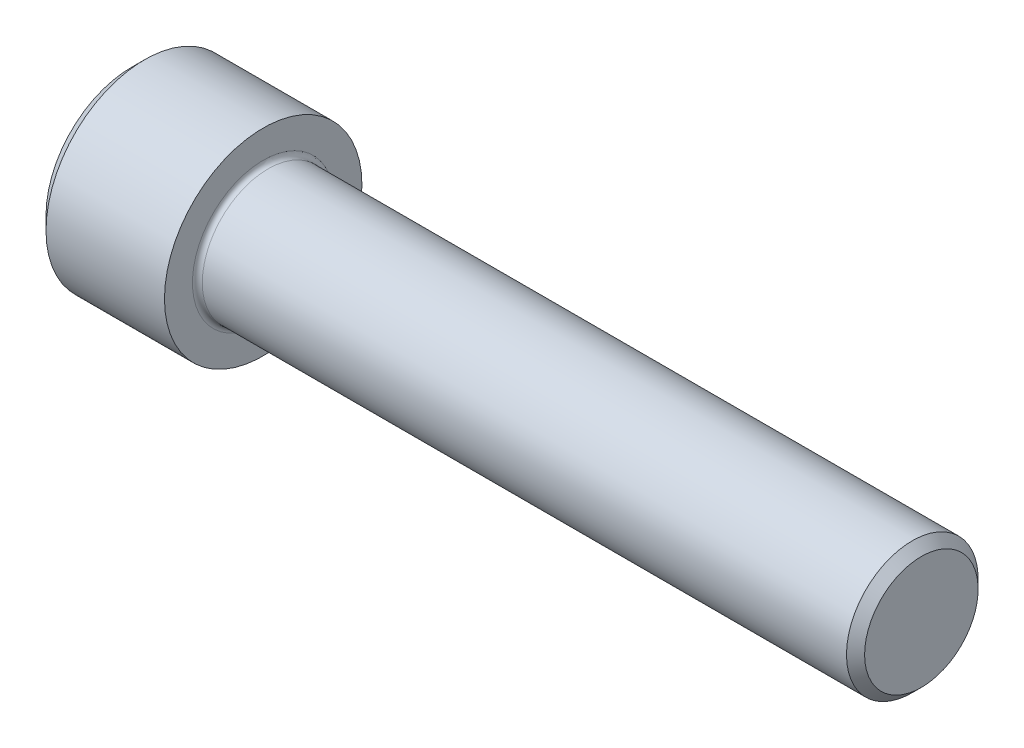
ISO-10303-21;
HEADER;
FILE_DESCRIPTION(('STEP AP214'),'2;1');
FILE_NAME('part.step','',(''),(''),'','','');
FILE_SCHEMA(('AUTOMOTIVE_DESIGN { 1 0 10303 214 1 1 1 1 }'));
ENDSEC;
DATA;
#1=APPLICATION_CONTEXT('core data for automotive mechanical design processes');
#2=APPLICATION_PROTOCOL_DEFINITION('international standard','automotive_design',2000,#1);
#3=PRODUCT_CONTEXT('',#1,'mechanical');
#4=PRODUCT('Part','Part','',(#3));
#5=PRODUCT_RELATED_PRODUCT_CATEGORY('part','',(#4));
#6=PRODUCT_DEFINITION_FORMATION('','',#4);
#7=PRODUCT_DEFINITION_CONTEXT('part definition',#1,'design');
#8=PRODUCT_DEFINITION('design','',#6,#7);
#9=PRODUCT_DEFINITION_SHAPE('','',#8);
#10=(LENGTH_UNIT() NAMED_UNIT(*) SI_UNIT(.MILLI.,.METRE.));
#11=(NAMED_UNIT(*) PLANE_ANGLE_UNIT() SI_UNIT($,.RADIAN.));
#12=(NAMED_UNIT(*) SI_UNIT($,.STERADIAN.) SOLID_ANGLE_UNIT());
#13=UNCERTAINTY_MEASURE_WITH_UNIT(LENGTH_MEASURE(1.E-05),#10,'distance_accuracy_value','');
#14=(GEOMETRIC_REPRESENTATION_CONTEXT(3) GLOBAL_UNCERTAINTY_ASSIGNED_CONTEXT((#13)) GLOBAL_UNIT_ASSIGNED_CONTEXT((#10,
#11,#12)) REPRESENTATION_CONTEXT('',''));
#15=CARTESIAN_POINT('',(0.,0.,0.));
#16=DIRECTION('',(0.,0.,1.));
#17=DIRECTION('',(1.,0.,0.));
#18=AXIS2_PLACEMENT_3D('',#15,#16,#17);
#19=CARTESIAN_POINT('',(0.,0.,0.));
#20=DIRECTION('',(-1.,0.,0.));
#21=DIRECTION('',(0.,0.,1.));
#22=AXIS2_PLACEMENT_3D('',#19,#20,#21);
#23=PLANE('',#22);
#24=DIRECTION('',(0.,-0.5,0.866025403784439));
#25=VECTOR('',#24,1.);
#26=CARTESIAN_POINT('',(0.,8.16488750687969,0.));
#27=LINE('',#26,#25);
#28=CARTESIAN_POINT('',(0.,8.16488750687969,0.));
#29=VERTEX_POINT('',#28);
#30=CARTESIAN_POINT('',(0.,4.08244375343985,7.07099999999999));
#31=VERTEX_POINT('',#30);
#32=EDGE_CURVE('E377',#29,#31,#27,.T.);
#33=ORIENTED_EDGE('',*,*,#32,.T.);
#34=DIRECTION('',(0.,1.,0.));
#35=VECTOR('',#34,1.);
#36=CARTESIAN_POINT('',(0.,-4.08244375343984,7.071));
#37=LINE('',#36,#35);
#38=CARTESIAN_POINT('',(0.,-4.08244375343984,7.071));
#39=VERTEX_POINT('',#38);
#40=EDGE_CURVE('E134',#39,#31,#37,.T.);
#41=ORIENTED_EDGE('',*,*,#40,.F.);
#42=DIRECTION('',(0.,-0.500000000000001,-0.866025403784438));
#43=VECTOR('',#42,1.);
#44=CARTESIAN_POINT('',(0.,-4.08244375343984,7.071));
#45=LINE('',#44,#43);
#46=CARTESIAN_POINT('',(0.,-8.1648875068797,0.));
#47=VERTEX_POINT('',#46);
#48=EDGE_CURVE('E380',#39,#47,#45,.T.);
#49=ORIENTED_EDGE('',*,*,#48,.T.);
#50=DIRECTION('',(0.,0.5,-0.866025403784439));
#51=VECTOR('',#50,1.);
#52=CARTESIAN_POINT('',(0.,-8.1648875068797,0.));
#53=LINE('',#52,#51);
#54=CARTESIAN_POINT('',(0.,-4.08244375343985,-7.071));
#55=VERTEX_POINT('',#54);
#56=EDGE_CURVE('E383',#47,#55,#53,.T.);
#57=ORIENTED_EDGE('',*,*,#56,.T.);
#58=DIRECTION('',(0.,-1.,0.));
#59=VECTOR('',#58,1.);
#60=CARTESIAN_POINT('',(0.,4.08244375343984,-7.07100000000001));
#61=LINE('',#60,#59);
#62=CARTESIAN_POINT('',(0.,4.08244375343984,-7.07100000000001));
#63=VERTEX_POINT('',#62);
#64=EDGE_CURVE('E386',#63,#55,#61,.T.);
#65=ORIENTED_EDGE('',*,*,#64,.F.);
#66=DIRECTION('',(0.,-0.500000000000001,-0.866025403784438));
#67=VECTOR('',#66,1.);
#68=CARTESIAN_POINT('',(0.,8.16488750687969,0.));
#69=LINE('',#68,#67);
#70=EDGE_CURVE('E129',#29,#63,#69,.T.);
#71=ORIENTED_EDGE('',*,*,#70,.F.);
#72=EDGE_LOOP('',(#33,#41,#49,#57,#65,#71));
#73=FACE_BOUND('',#72,.T.);
#74=CARTESIAN_POINT('',(0.,0.,0.));
#75=DIRECTION('',(-1.,0.,0.));
#76=DIRECTION('',(0.,0.,1.));
#77=AXIS2_PLACEMENT_3D('',#74,#75,#76);
#78=CIRCLE('',#77,10.4);
#79=CARTESIAN_POINT('',(0.,0.,10.4));
#80=VERTEX_POINT('',#79);
#81=EDGE_CURVE('E145',#80,#80,#78,.T.);
#82=ORIENTED_EDGE('',*,*,#81,.T.);
#83=EDGE_LOOP('',(#82));
#84=FACE_BOUND('',#83,.T.);
#85=ADVANCED_FACE('F38',(#73,#84),#23,.T.);
#86=CARTESIAN_POINT('',(96.,6.8985,0.));
#87=DIRECTION('',(1.,0.,0.));
#88=DIRECTION('',(0.,0.,-1.));
#89=AXIS2_PLACEMENT_3D('',#86,#87,#88);
#90=PLANE('',#89);
#91=CARTESIAN_POINT('',(96.,0.,0.));
#92=DIRECTION('',(-1.,0.,0.));
#93=DIRECTION('',(0.,0.,1.));
#94=AXIS2_PLACEMENT_3D('',#91,#92,#93);
#95=CIRCLE('',#94,6.8985);
#96=CARTESIAN_POINT('',(96.,0.,6.8985));
#97=VERTEX_POINT('',#96);
#98=EDGE_CURVE('E158',#97,#97,#95,.T.);
#99=ORIENTED_EDGE('',*,*,#98,.F.);
#100=EDGE_LOOP('',(#99));
#101=FACE_BOUND('',#100,.T.);
#102=ADVANCED_FACE('F179',(#101),#90,.T.);
#103=CARTESIAN_POINT('',(96.,0.,0.));
#104=DIRECTION('',(-1.,0.,0.));
#105=DIRECTION('',(0.,0.,1.));
#106=AXIS2_PLACEMENT_3D('',#103,#104,#105);
#107=CONICAL_SURFACE('',#106,6.8985,0.785398163397322);
#108=CARTESIAN_POINT('',(94.8984999999999,0.,0.));
#109=DIRECTION('',(-1.,0.,0.));
#110=DIRECTION('',(0.,0.,1.));
#111=AXIS2_PLACEMENT_3D('',#108,#109,#110);
#112=CIRCLE('',#111,7.99999999999987);
#113=CARTESIAN_POINT('',(94.8984999999999,0.,7.99999999999987));
#114=VERTEX_POINT('',#113);
#115=EDGE_CURVE('E155',#114,#114,#112,.T.);
#116=ORIENTED_EDGE('',*,*,#115,.F.);
#117=EDGE_LOOP('',(#116));
#118=FACE_BOUND('',#117,.T.);
#119=ORIENTED_EDGE('',*,*,#98,.T.);
#120=EDGE_LOOP('',(#119));
#121=FACE_BOUND('',#120,.T.);
#122=ADVANCED_FACE('F185',(#118,#121),#107,.T.);
#123=CARTESIAN_POINT('',(-31.75,0.,0.));
#124=DIRECTION('',(-1.,0.,0.));
#125=DIRECTION('',(0.,0.,1.));
#126=AXIS2_PLACEMENT_3D('',#123,#124,#125);
#127=CYLINDRICAL_SURFACE('',#126,7.99999999999993);
#128=CARTESIAN_POINT('',(16.6,0.,0.));
#129=DIRECTION('',(1.,0.,0.));
#130=DIRECTION('',(0.,0.,-1.));
#131=AXIS2_PLACEMENT_3D('',#128,#129,#130);
#132=CIRCLE('',#131,7.99999999999993);
#133=CARTESIAN_POINT('',(16.6,0.,-7.99999999999993));
#134=VERTEX_POINT('',#133);
#135=EDGE_CURVE('E11',#134,#134,#132,.T.);
#136=ORIENTED_EDGE('',*,*,#135,.T.);
#137=EDGE_LOOP('',(#136));
#138=FACE_BOUND('',#137,.T.);
#139=ORIENTED_EDGE('',*,*,#115,.T.);
#140=EDGE_LOOP('',(#139));
#141=FACE_BOUND('',#140,.T.);
#142=ADVANCED_FACE('F196',(#138,#141),#127,.T.);
#143=CARTESIAN_POINT('',(16.,12.,0.));
#144=DIRECTION('',(1.,0.,0.));
#145=DIRECTION('',(0.,0.,-1.));
#146=AXIS2_PLACEMENT_3D('',#143,#144,#145);
#147=PLANE('',#146);
#148=CARTESIAN_POINT('',(16.,0.,0.));
#149=DIRECTION('',(1.,0.,0.));
#150=DIRECTION('',(0.,0.,-1.));
#151=AXIS2_PLACEMENT_3D('',#148,#149,#150);
#152=CIRCLE('',#151,8.59999999999993);
#153=CARTESIAN_POINT('',(16.,0.,-8.59999999999993));
#154=VERTEX_POINT('',#153);
#155=EDGE_CURVE('E46',#154,#154,#152,.F.);
#156=ORIENTED_EDGE('',*,*,#155,.T.);
#157=EDGE_LOOP('',(#156));
#158=FACE_BOUND('',#157,.T.);
#159=CARTESIAN_POINT('',(16.,0.,0.));
#160=DIRECTION('',(-1.,0.,0.));
#161=DIRECTION('',(0.,0.,1.));
#162=AXIS2_PLACEMENT_3D('',#159,#160,#161);
#163=CIRCLE('',#162,12.);
#164=CARTESIAN_POINT('',(16.,0.,12.));
#165=VERTEX_POINT('',#164);
#166=EDGE_CURVE('E152',#165,#165,#163,.T.);
#167=ORIENTED_EDGE('',*,*,#166,.F.);
#168=EDGE_LOOP('',(#167));
#169=FACE_BOUND('',#168,.T.);
#170=ADVANCED_FACE('F163',(#158,#169),#147,.T.);
#171=CARTESIAN_POINT('',(-31.75,0.,0.));
#172=DIRECTION('',(-1.,0.,0.));
#173=DIRECTION('',(0.,0.,1.));
#174=AXIS2_PLACEMENT_3D('',#171,#172,#173);
#175=CYLINDRICAL_SURFACE('',#174,12.);
#176=ORIENTED_EDGE('',*,*,#166,.T.);
#177=EDGE_LOOP('',(#176));
#178=FACE_BOUND('',#177,.T.);
#179=CARTESIAN_POINT('',(1.6,0.,0.));
#180=DIRECTION('',(-1.,0.,0.));
#181=DIRECTION('',(0.,0.,1.));
#182=AXIS2_PLACEMENT_3D('',#179,#180,#181);
#183=CIRCLE('',#182,12.);
#184=CARTESIAN_POINT('',(1.6,0.,12.));
#185=VERTEX_POINT('',#184);
#186=EDGE_CURVE('E149',#185,#185,#183,.T.);
#187=ORIENTED_EDGE('',*,*,#186,.F.);
#188=EDGE_LOOP('',(#187));
#189=FACE_BOUND('',#188,.T.);
#190=ADVANCED_FACE('F174',(#178,#189),#175,.T.);
#191=CARTESIAN_POINT('',(0.,0.,0.));
#192=DIRECTION('',(1.,0.,0.));
#193=DIRECTION('',(0.,0.,-1.));
#194=AXIS2_PLACEMENT_3D('',#191,#192,#193);
#195=CONICAL_SURFACE('',#194,10.4,0.785398163397447);
#196=ORIENTED_EDGE('',*,*,#186,.T.);
#197=EDGE_LOOP('',(#196));
#198=FACE_BOUND('',#197,.T.);
#199=ORIENTED_EDGE('',*,*,#81,.F.);
#200=EDGE_LOOP('',(#199));
#201=FACE_BOUND('',#200,.T.);
#202=ADVANCED_FACE('F167',(#198,#201),#195,.T.);
#203=CARTESIAN_POINT('',(16.6,0.,0.));
#204=DIRECTION('',(1.,0.,0.));
#205=DIRECTION('',(0.,0.,-1.));
#206=AXIS2_PLACEMENT_3D('',#203,#204,#205);
#207=TOROIDAL_SURFACE('',#206,8.59999999999993,0.6);
#208=ORIENTED_EDGE('',*,*,#135,.F.);
#209=EDGE_LOOP('',(#208));
#210=FACE_BOUND('',#209,.T.);
#211=ORIENTED_EDGE('',*,*,#155,.F.);
#212=EDGE_LOOP('',(#211));
#213=FACE_BOUND('',#212,.T.);
#214=ADVANCED_FACE('F40',(#210,#213),#207,.F.);
#215=CARTESIAN_POINT('',(8.,8.16488750687969,0.));
#216=DIRECTION('',(0.,-0.866025403784439,-0.5));
#217=DIRECTION('',(0.,0.5,-0.866025403784439));
#218=AXIS2_PLACEMENT_3D('',#215,#216,#217);
#219=PLANE('',#218);
#220=ORIENTED_EDGE('',*,*,#32,.F.);
#221=DIRECTION('',(-1.,0.,0.));
#222=VECTOR('',#221,1.);
#223=CARTESIAN_POINT('',(8.,8.16488750687969,0.));
#224=LINE('',#223,#222);
#225=CARTESIAN_POINT('',(8.,8.16488750687969,0.));
#226=VERTEX_POINT('',#225);
#227=EDGE_CURVE('E367',#226,#29,#224,.T.);
#228=ORIENTED_EDGE('',*,*,#227,.F.);
#229=DIRECTION('',(0.,-0.5,0.866025403784439));
#230=VECTOR('',#229,1.);
#231=CARTESIAN_POINT('',(8.,8.16488750687969,0.));
#232=LINE('',#231,#230);
#233=CARTESIAN_POINT('',(8.,6.12366563015976,3.5355));
#234=VERTEX_POINT('',#233);
#235=EDGE_CURVE('E121',#226,#234,#232,.T.);
#236=ORIENTED_EDGE('',*,*,#235,.T.);
#237=CARTESIAN_POINT('',(8.,4.08244375343985,7.07099999999999));
#238=VERTEX_POINT('',#237);
#239=EDGE_CURVE('E112',#234,#238,#232,.T.);
#240=ORIENTED_EDGE('',*,*,#239,.T.);
#241=DIRECTION('',(-1.,0.,0.));
#242=VECTOR('',#241,1.);
#243=CARTESIAN_POINT('',(8.,4.08244375343985,7.07099999999999));
#244=LINE('',#243,#242);
#245=EDGE_CURVE('E126',#238,#31,#244,.T.);
#246=ORIENTED_EDGE('',*,*,#245,.T.);
#247=EDGE_LOOP('',(#220,#228,#236,#240,#246));
#248=FACE_BOUND('',#247,.T.);
#249=ADVANCED_FACE('F125',(#248),#219,.T.);
#250=CARTESIAN_POINT('',(8.,-4.08244375343984,7.071));
#251=DIRECTION('',(0.,0.,1.));
#252=DIRECTION('',(0.,-1.,0.));
#253=AXIS2_PLACEMENT_3D('',#250,#251,#252);
#254=PLANE('',#253);
#255=ORIENTED_EDGE('',*,*,#40,.T.);
#256=ORIENTED_EDGE('',*,*,#245,.F.);
#257=DIRECTION('',(0.,1.,0.));
#258=VECTOR('',#257,1.);
#259=CARTESIAN_POINT('',(8.,-4.08244375343984,7.071));
#260=LINE('',#259,#258);
#261=CARTESIAN_POINT('',(8.,0.,7.071));
#262=VERTEX_POINT('',#261);
#263=EDGE_CURVE('E109',#262,#238,#260,.T.);
#264=ORIENTED_EDGE('',*,*,#263,.F.);
#265=CARTESIAN_POINT('',(8.,-4.08244375343984,7.071));
#266=VERTEX_POINT('',#265);
#267=EDGE_CURVE('E120',#266,#262,#260,.T.);
#268=ORIENTED_EDGE('',*,*,#267,.F.);
#269=DIRECTION('',(-1.,0.,0.));
#270=VECTOR('',#269,1.);
#271=CARTESIAN_POINT('',(8.,-4.08244375343984,7.071));
#272=LINE('',#271,#270);
#273=EDGE_CURVE('E136',#266,#39,#272,.T.);
#274=ORIENTED_EDGE('',*,*,#273,.T.);
#275=EDGE_LOOP('',(#255,#256,#264,#268,#274));
#276=FACE_BOUND('',#275,.T.);
#277=ADVANCED_FACE('F131',(#276),#254,.F.);
#278=CARTESIAN_POINT('',(8.,-4.08244375343984,7.071));
#279=DIRECTION('',(0.,0.866025403784438,-0.500000000000001));
#280=DIRECTION('',(0.,0.500000000000001,0.866025403784438));
#281=AXIS2_PLACEMENT_3D('',#278,#279,#280);
#282=PLANE('',#281);
#283=ORIENTED_EDGE('',*,*,#48,.F.);
#284=ORIENTED_EDGE('',*,*,#273,.F.);
#285=DIRECTION('',(0.,-0.500000000000001,-0.866025403784438));
#286=VECTOR('',#285,1.);
#287=CARTESIAN_POINT('',(8.,-4.08244375343984,7.071));
#288=LINE('',#287,#286);
#289=CARTESIAN_POINT('',(8.,-6.12366563015977,3.53550000000001));
#290=VERTEX_POINT('',#289);
#291=EDGE_CURVE('E406',#266,#290,#288,.T.);
#292=ORIENTED_EDGE('',*,*,#291,.T.);
#293=CARTESIAN_POINT('',(8.,-8.1648875068797,0.));
#294=VERTEX_POINT('',#293);
#295=EDGE_CURVE('E395',#290,#294,#288,.T.);
#296=ORIENTED_EDGE('',*,*,#295,.T.);
#297=DIRECTION('',(-1.,0.,0.));
#298=VECTOR('',#297,1.);
#299=CARTESIAN_POINT('',(8.,-8.1648875068797,0.));
#300=LINE('',#299,#298);
#301=EDGE_CURVE('E141',#294,#47,#300,.T.);
#302=ORIENTED_EDGE('',*,*,#301,.T.);
#303=EDGE_LOOP('',(#283,#284,#292,#296,#302));
#304=FACE_BOUND('',#303,.T.);
#305=ADVANCED_FACE('F258',(#304),#282,.T.);
#306=CARTESIAN_POINT('',(8.,-8.1648875068797,0.));
#307=DIRECTION('',(0.,0.866025403784439,0.5));
#308=DIRECTION('',(0.,-0.5,0.866025403784439));
#309=AXIS2_PLACEMENT_3D('',#306,#307,#308);
#310=PLANE('',#309);
#311=ORIENTED_EDGE('',*,*,#56,.F.);
#312=ORIENTED_EDGE('',*,*,#301,.F.);
#313=DIRECTION('',(0.,0.5,-0.866025403784439));
#314=VECTOR('',#313,1.);
#315=CARTESIAN_POINT('',(8.,-8.1648875068797,0.));
#316=LINE('',#315,#314);
#317=CARTESIAN_POINT('',(8.,-6.12366563015977,-3.5355));
#318=VERTEX_POINT('',#317);
#319=EDGE_CURVE('E373',#294,#318,#316,.T.);
#320=ORIENTED_EDGE('',*,*,#319,.T.);
#321=CARTESIAN_POINT('',(8.,-4.08244375343985,-7.071));
#322=VERTEX_POINT('',#321);
#323=EDGE_CURVE('E405',#318,#322,#316,.T.);
#324=ORIENTED_EDGE('',*,*,#323,.T.);
#325=DIRECTION('',(-1.,0.,0.));
#326=VECTOR('',#325,1.);
#327=CARTESIAN_POINT('',(8.,-4.08244375343985,-7.071));
#328=LINE('',#327,#326);
#329=EDGE_CURVE('E366',#322,#55,#328,.T.);
#330=ORIENTED_EDGE('',*,*,#329,.T.);
#331=EDGE_LOOP('',(#311,#312,#320,#324,#330));
#332=FACE_BOUND('',#331,.T.);
#333=ADVANCED_FACE('F266',(#332),#310,.T.);
#334=CARTESIAN_POINT('',(8.,4.08244375343984,-7.07100000000001));
#335=DIRECTION('',(0.,0.,-1.));
#336=DIRECTION('',(0.,1.,0.));
#337=AXIS2_PLACEMENT_3D('',#334,#335,#336);
#338=PLANE('',#337);
#339=ORIENTED_EDGE('',*,*,#64,.T.);
#340=ORIENTED_EDGE('',*,*,#329,.F.);
#341=DIRECTION('',(0.,-1.,0.));
#342=VECTOR('',#341,1.);
#343=CARTESIAN_POINT('',(8.,4.08244375343984,-7.07100000000001));
#344=LINE('',#343,#342);
#345=CARTESIAN_POINT('',(8.,0.,-7.071));
#346=VERTEX_POINT('',#345);
#347=EDGE_CURVE('E370',#346,#322,#344,.T.);
#348=ORIENTED_EDGE('',*,*,#347,.F.);
#349=CARTESIAN_POINT('',(8.,4.08244375343984,-7.07100000000001));
#350=VERTEX_POINT('',#349);
#351=EDGE_CURVE('E53',#350,#346,#344,.T.);
#352=ORIENTED_EDGE('',*,*,#351,.F.);
#353=DIRECTION('',(-1.,0.,0.));
#354=VECTOR('',#353,1.);
#355=CARTESIAN_POINT('',(8.,4.08244375343984,-7.07100000000001));
#356=LINE('',#355,#354);
#357=EDGE_CURVE('E363',#350,#63,#356,.T.);
#358=ORIENTED_EDGE('',*,*,#357,.T.);
#359=EDGE_LOOP('',(#339,#340,#348,#352,#358));
#360=FACE_BOUND('',#359,.T.);
#361=ADVANCED_FACE('F275',(#360),#338,.F.);
#362=CARTESIAN_POINT('',(8.,8.16488750687969,0.));
#363=DIRECTION('',(0.,0.866025403784438,-0.500000000000001));
#364=DIRECTION('',(0.,0.500000000000001,0.866025403784438));
#365=AXIS2_PLACEMENT_3D('',#362,#363,#364);
#366=PLANE('',#365);
#367=ORIENTED_EDGE('',*,*,#70,.T.);
#368=ORIENTED_EDGE('',*,*,#357,.F.);
#369=DIRECTION('',(0.,-0.500000000000001,-0.866025403784438));
#370=VECTOR('',#369,1.);
#371=CARTESIAN_POINT('',(8.,8.16488750687969,0.));
#372=LINE('',#371,#370);
#373=CARTESIAN_POINT('',(8.,6.12366563015976,-3.53550000000001));
#374=VERTEX_POINT('',#373);
#375=EDGE_CURVE('E353',#374,#350,#372,.T.);
#376=ORIENTED_EDGE('',*,*,#375,.F.);
#377=EDGE_CURVE('E359',#226,#374,#372,.T.);
#378=ORIENTED_EDGE('',*,*,#377,.F.);
#379=ORIENTED_EDGE('',*,*,#227,.T.);
#380=EDGE_LOOP('',(#367,#368,#376,#378,#379));
#381=FACE_BOUND('',#380,.T.);
#382=ADVANCED_FACE('F284',(#381),#366,.F.);
#383=CARTESIAN_POINT('',(8.,8.16488750687969,0.));
#384=DIRECTION('',(1.,0.,0.));
#385=DIRECTION('',(0.,0.,-1.));
#386=AXIS2_PLACEMENT_3D('',#383,#384,#385);
#387=PLANE('',#386);
#388=ORIENTED_EDGE('',*,*,#347,.T.);
#389=ORIENTED_EDGE('',*,*,#323,.F.);
#390=CARTESIAN_POINT('',(8.,0.,0.));
#391=DIRECTION('',(-1.,0.,0.));
#392=DIRECTION('',(0.,0.,1.));
#393=AXIS2_PLACEMENT_3D('',#390,#391,#392);
#394=CIRCLE('',#393,7.071);
#395=EDGE_CURVE('E401',#346,#318,#394,.T.);
#396=ORIENTED_EDGE('',*,*,#395,.F.);
#397=EDGE_LOOP('',(#388,#389,#396));
#398=FACE_BOUND('',#397,.T.);
#399=ADVANCED_FACE('F293',(#398),#387,.F.);
#400=ORIENTED_EDGE('',*,*,#319,.F.);
#401=ORIENTED_EDGE('',*,*,#295,.F.);
#402=EDGE_CURVE('E139',#318,#290,#394,.T.);
#403=ORIENTED_EDGE('',*,*,#402,.F.);
#404=EDGE_LOOP('',(#400,#401,#403));
#405=FACE_BOUND('',#404,.T.);
#406=ADVANCED_FACE('F302',(#405),#387,.F.);
#407=ORIENTED_EDGE('',*,*,#291,.F.);
#408=ORIENTED_EDGE('',*,*,#267,.T.);
#409=EDGE_CURVE('E135',#290,#262,#394,.T.);
#410=ORIENTED_EDGE('',*,*,#409,.F.);
#411=EDGE_LOOP('',(#407,#408,#410));
#412=FACE_BOUND('',#411,.T.);
#413=ADVANCED_FACE('F311',(#412),#387,.F.);
#414=ORIENTED_EDGE('',*,*,#263,.T.);
#415=ORIENTED_EDGE('',*,*,#239,.F.);
#416=EDGE_CURVE('E115',#262,#234,#394,.T.);
#417=ORIENTED_EDGE('',*,*,#416,.F.);
#418=EDGE_LOOP('',(#414,#415,#417));
#419=FACE_BOUND('',#418,.T.);
#420=ADVANCED_FACE('F111',(#419),#387,.F.);
#421=ORIENTED_EDGE('',*,*,#235,.F.);
#422=ORIENTED_EDGE('',*,*,#377,.T.);
#423=EDGE_CURVE('E146',#234,#374,#394,.T.);
#424=ORIENTED_EDGE('',*,*,#423,.F.);
#425=EDGE_LOOP('',(#421,#422,#424));
#426=FACE_BOUND('',#425,.T.);
#427=ADVANCED_FACE('F326',(#426),#387,.F.);
#428=ORIENTED_EDGE('',*,*,#375,.T.);
#429=ORIENTED_EDGE('',*,*,#351,.T.);
#430=EDGE_CURVE('E356',#374,#346,#394,.T.);
#431=ORIENTED_EDGE('',*,*,#430,.F.);
#432=EDGE_LOOP('',(#428,#429,#431));
#433=FACE_BOUND('',#432,.T.);
#434=ADVANCED_FACE('F241',(#433),#387,.F.);
#435=CARTESIAN_POINT('',(8.,0.,0.));
#436=DIRECTION('',(-1.,0.,0.));
#437=DIRECTION('',(0.,0.,1.));
#438=AXIS2_PLACEMENT_3D('',#435,#436,#437);
#439=CONICAL_SURFACE('',#438,7.071,1.04719755119659);
#440=CARTESIAN_POINT('',(12.0824437534399,0.,0.));
#441=VERTEX_POINT('',#440);
#442=VERTEX_LOOP('',#441);
#443=FACE_BOUND('',#442,.T.);
#444=ORIENTED_EDGE('',*,*,#416,.T.);
#445=ORIENTED_EDGE('',*,*,#423,.T.);
#446=ORIENTED_EDGE('',*,*,#430,.T.);
#447=ORIENTED_EDGE('',*,*,#395,.T.);
#448=ORIENTED_EDGE('',*,*,#402,.T.);
#449=ORIENTED_EDGE('',*,*,#409,.T.);
#450=EDGE_LOOP('',(#444,#445,#446,#447,#448,#449));
#451=FACE_BOUND('',#450,.T.);
#452=ADVANCED_FACE('F189',(#443,#451),#439,.F.);
#453=CLOSED_SHELL('',(#85,#102,#122,#142,#170,#190,#202,#214,#249,#277,#305,#333,#361,#382,#399,
#406,#413,#420,#427,#434,#452));
#454=MANIFOLD_SOLID_BREP('B2',#453);
#455=ADVANCED_BREP_SHAPE_REPRESENTATION('',(#18,#454),#14);
#456=SHAPE_DEFINITION_REPRESENTATION(#9,#455);
ENDSEC;
END-ISO-10303-21;
